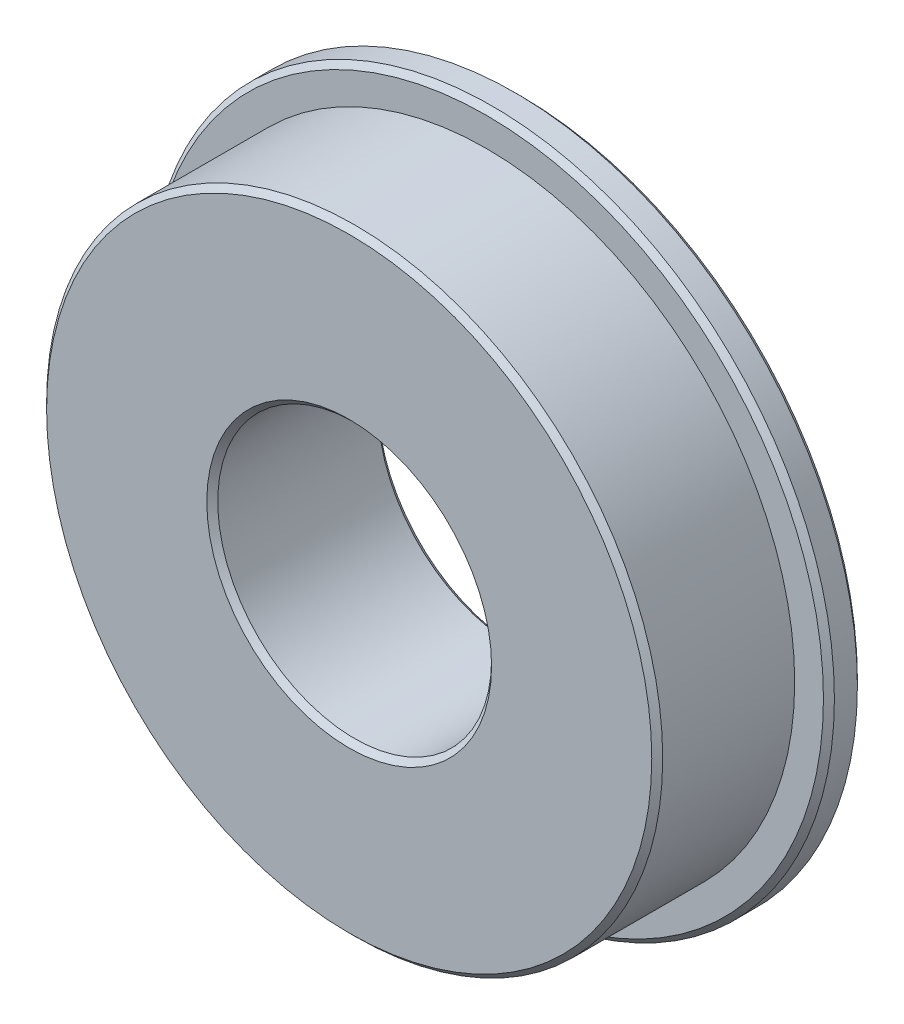
ISO-10303-21;
HEADER;
FILE_DESCRIPTION(('STEP AP214'),'2;1');
FILE_NAME('part.step','',(''),(''),'','','');
FILE_SCHEMA(('AUTOMOTIVE_DESIGN { 1 0 10303 214 1 1 1 1 }'));
ENDSEC;
DATA;
#1=APPLICATION_CONTEXT('core data for automotive mechanical design processes');
#2=APPLICATION_PROTOCOL_DEFINITION('international standard','automotive_design',2000,#1);
#3=PRODUCT_CONTEXT('',#1,'mechanical');
#4=PRODUCT('Part','Part','',(#3));
#5=PRODUCT_RELATED_PRODUCT_CATEGORY('part','',(#4));
#6=PRODUCT_DEFINITION_FORMATION('','',#4);
#7=PRODUCT_DEFINITION_CONTEXT('part definition',#1,'design');
#8=PRODUCT_DEFINITION('design','',#6,#7);
#9=PRODUCT_DEFINITION_SHAPE('','',#8);
#10=(LENGTH_UNIT() NAMED_UNIT(*) SI_UNIT(.MILLI.,.METRE.));
#11=(NAMED_UNIT(*) PLANE_ANGLE_UNIT() SI_UNIT($,.RADIAN.));
#12=(NAMED_UNIT(*) SI_UNIT($,.STERADIAN.) SOLID_ANGLE_UNIT());
#13=UNCERTAINTY_MEASURE_WITH_UNIT(LENGTH_MEASURE(1.E-05),#10,'distance_accuracy_value','');
#14=(GEOMETRIC_REPRESENTATION_CONTEXT(3) GLOBAL_UNCERTAINTY_ASSIGNED_CONTEXT((#13)) GLOBAL_UNIT_ASSIGNED_CONTEXT((#10,
#11,#12)) REPRESENTATION_CONTEXT('',''));
#15=CARTESIAN_POINT('',(0.,0.,0.));
#16=DIRECTION('',(0.,0.,1.));
#17=DIRECTION('',(1.,0.,0.));
#18=AXIS2_PLACEMENT_3D('',#15,#16,#17);
#19=CARTESIAN_POINT('',(-8.86153846153846,6.04195804195805,7.69619999999998));
#20=DIRECTION('',(0.,0.,-1.));
#21=DIRECTION('',(-1.,0.,0.));
#22=AXIS2_PLACEMENT_3D('',#19,#20,#21);
#23=CONICAL_SURFACE('',#22,14.2875,0.785398163397453);
#24=CARTESIAN_POINT('',(-8.86153846153846,6.04195804195805,7.95019999999999));
#25=DIRECTION('',(0.,0.,-1.));
#26=DIRECTION('',(-1.,0.,0.));
#27=AXIS2_PLACEMENT_3D('',#24,#25,#26);
#28=CIRCLE('',#27,14.0335);
#29=CARTESIAN_POINT('',(-22.8950384615385,6.04195804195805,7.95019999999999));
#30=VERTEX_POINT('',#29);
#31=EDGE_CURVE('E18',#30,#30,#28,.T.);
#32=ORIENTED_EDGE('',*,*,#31,.T.);
#33=EDGE_LOOP('',(#32));
#34=FACE_BOUND('',#33,.T.);
#35=CARTESIAN_POINT('',(-8.86153846153846,6.04195804195805,7.69619999999999));
#36=DIRECTION('',(0.,0.,1.));
#37=DIRECTION('',(1.,0.,0.));
#38=AXIS2_PLACEMENT_3D('',#35,#36,#37);
#39=CIRCLE('',#38,14.2875);
#40=CARTESIAN_POINT('',(5.42596153846154,6.04195804195805,7.69619999999999));
#41=VERTEX_POINT('',#40);
#42=EDGE_CURVE('E30',#41,#41,#39,.F.);
#43=ORIENTED_EDGE('',*,*,#42,.F.);
#44=EDGE_LOOP('',(#43));
#45=FACE_BOUND('',#44,.T.);
#46=ADVANCED_FACE('F15',(#34,#45),#23,.T.);
#47=CARTESIAN_POINT('',(-8.86153846153846,6.04195804195805,7.95019999999999));
#48=DIRECTION('',(0.,0.,1.));
#49=DIRECTION('',(1.,0.,0.));
#50=AXIS2_PLACEMENT_3D('',#47,#48,#49);
#51=CYLINDRICAL_SURFACE('',#50,14.2875);
#52=CARTESIAN_POINT('',(-8.86153846153846,6.04195804195805,1.57479999999999));
#53=DIRECTION('',(0.,0.,1.));
#54=DIRECTION('',(1.,0.,0.));
#55=AXIS2_PLACEMENT_3D('',#52,#53,#54);
#56=CIRCLE('',#55,14.2875);
#57=CARTESIAN_POINT('',(5.42596153846154,6.04195804195805,1.57479999999999));
#58=VERTEX_POINT('',#57);
#59=EDGE_CURVE('E39',#58,#58,#56,.T.);
#60=ORIENTED_EDGE('',*,*,#59,.T.);
#61=EDGE_LOOP('',(#60));
#62=FACE_BOUND('',#61,.T.);
#63=ORIENTED_EDGE('',*,*,#42,.T.);
#64=EDGE_LOOP('',(#63));
#65=FACE_BOUND('',#64,.T.);
#66=ADVANCED_FACE('F49',(#62,#65),#51,.T.);
#67=CARTESIAN_POINT('',(-8.86153846153846,6.04195804195805,7.95019999999999));
#68=DIRECTION('',(0.,0.,-1.));
#69=DIRECTION('',(-1.,0.,0.));
#70=AXIS2_PLACEMENT_3D('',#67,#68,#69);
#71=PLANE('',#70);
#72=ORIENTED_EDGE('',*,*,#31,.F.);
#73=EDGE_LOOP('',(#72));
#74=FACE_BOUND('',#73,.T.);
#75=CARTESIAN_POINT('',(-8.86153846153846,6.04195804195805,7.95019999998203));
#76=DIRECTION('',(0.,0.,1.));
#77=DIRECTION('',(1.,0.,0.));
#78=AXIS2_PLACEMENT_3D('',#75,#76,#77);
#79=CIRCLE('',#78,6.60399999993232);
#80=CARTESIAN_POINT('',(-2.25753846160615,6.04195804195805,7.95019999998203));
#81=VERTEX_POINT('',#80);
#82=EDGE_CURVE('E37',#81,#81,#79,.F.);
#83=ORIENTED_EDGE('',*,*,#82,.T.);
#84=EDGE_LOOP('',(#83));
#85=FACE_BOUND('',#84,.T.);
#86=ADVANCED_FACE('F56',(#74,#85),#71,.F.);
#87=CARTESIAN_POINT('',(-8.86153846153846,6.04195804195805,1.57479999999999));
#88=DIRECTION('',(0.,0.,-1.));
#89=DIRECTION('',(-1.,0.,0.));
#90=AXIS2_PLACEMENT_3D('',#87,#88,#89);
#91=PLANE('',#90);
#92=ORIENTED_EDGE('',*,*,#59,.F.);
#93=EDGE_LOOP('',(#92));
#94=FACE_BOUND('',#93,.T.);
#95=CARTESIAN_POINT('',(-8.86153846153846,6.04195804195805,1.5748));
#96=DIRECTION('',(0.,0.,-1.));
#97=DIRECTION('',(-1.,0.,0.));
#98=AXIS2_PLACEMENT_3D('',#95,#96,#97);
#99=CIRCLE('',#98,15.621);
#100=CARTESIAN_POINT('',(-24.4825384615385,6.04195804195805,1.5748));
#101=VERTEX_POINT('',#100);
#102=EDGE_CURVE('E33',#101,#101,#99,.T.);
#103=ORIENTED_EDGE('',*,*,#102,.F.);
#104=EDGE_LOOP('',(#103));
#105=FACE_BOUND('',#104,.T.);
#106=ADVANCED_FACE('F87',(#94,#105),#91,.F.);
#107=CARTESIAN_POINT('',(-8.86153846153846,6.04195804195805,7.95019999986835));
#108=DIRECTION('',(0.,0.,1.));
#109=DIRECTION('',(1.,0.,0.));
#110=AXIS2_PLACEMENT_3D('',#107,#108,#109);
#111=CONICAL_SURFACE('',#110,6.60399999981863,0.785398163285552);
#112=CARTESIAN_POINT('',(-8.86153846153846,6.04195804195805,7.69619999999999));
#113=DIRECTION('',(0.,0.,1.));
#114=DIRECTION('',(1.,0.,0.));
#115=AXIS2_PLACEMENT_3D('',#112,#113,#114);
#116=CIRCLE('',#115,6.35);
#117=CARTESIAN_POINT('',(-2.51153846153846,6.04195804195805,7.69619999999999));
#118=VERTEX_POINT('',#117);
#119=EDGE_CURVE('E36',#118,#118,#116,.F.);
#120=ORIENTED_EDGE('',*,*,#119,.T.);
#121=EDGE_LOOP('',(#120));
#122=FACE_BOUND('',#121,.T.);
#123=ORIENTED_EDGE('',*,*,#82,.F.);
#124=EDGE_LOOP('',(#123));
#125=FACE_BOUND('',#124,.T.);
#126=ADVANCED_FACE('F83',(#122,#125),#111,.F.);
#127=CARTESIAN_POINT('',(-8.86153846153846,6.04195804195805,1.32080000000001));
#128=DIRECTION('',(0.,0.,-1.));
#129=DIRECTION('',(-1.,0.,0.));
#130=AXIS2_PLACEMENT_3D('',#127,#128,#129);
#131=CONICAL_SURFACE('',#130,15.875,0.785398163397452);
#132=CARTESIAN_POINT('',(-8.86153846153846,6.04195804195805,1.32080000000001));
#133=DIRECTION('',(0.,0.,1.));
#134=DIRECTION('',(1.,0.,0.));
#135=AXIS2_PLACEMENT_3D('',#132,#133,#134);
#136=CIRCLE('',#135,15.875);
#137=CARTESIAN_POINT('',(7.01346153846154,6.04195804195805,1.32080000000001));
#138=VERTEX_POINT('',#137);
#139=EDGE_CURVE('E171',#138,#138,#136,.F.);
#140=ORIENTED_EDGE('',*,*,#139,.F.);
#141=EDGE_LOOP('',(#140));
#142=FACE_BOUND('',#141,.T.);
#143=ORIENTED_EDGE('',*,*,#102,.T.);
#144=EDGE_LOOP('',(#143));
#145=FACE_BOUND('',#144,.T.);
#146=ADVANCED_FACE('F79',(#142,#145),#131,.T.);
#147=CARTESIAN_POINT('',(-8.86153846153846,6.04195804195805,1.57479999999999));
#148=DIRECTION('',(0.,0.,1.));
#149=DIRECTION('',(1.,0.,0.));
#150=AXIS2_PLACEMENT_3D('',#147,#148,#149);
#151=CYLINDRICAL_SURFACE('',#150,6.35);
#152=ORIENTED_EDGE('',*,*,#119,.F.);
#153=EDGE_LOOP('',(#152));
#154=FACE_BOUND('',#153,.T.);
#155=CARTESIAN_POINT('',(-8.86153846153846,6.04195804195805,0.253999999927146));
#156=DIRECTION('',(0.,0.,-1.));
#157=DIRECTION('',(-1.,0.,0.));
#158=AXIS2_PLACEMENT_3D('',#155,#156,#157);
#159=CIRCLE('',#158,6.3499999999901);
#160=CARTESIAN_POINT('',(-15.2115384615286,6.04195804195805,0.253999999927146));
#161=VERTEX_POINT('',#160);
#162=EDGE_CURVE('E173',#161,#161,#159,.T.);
#163=ORIENTED_EDGE('',*,*,#162,.T.);
#164=EDGE_LOOP('',(#163));
#165=FACE_BOUND('',#164,.T.);
#166=ADVANCED_FACE('F75',(#154,#165),#151,.F.);
#167=CARTESIAN_POINT('',(-8.86153846153846,6.04195804195805,1.57479999999999));
#168=DIRECTION('',(0.,0.,1.));
#169=DIRECTION('',(1.,0.,0.));
#170=AXIS2_PLACEMENT_3D('',#167,#168,#169);
#171=CYLINDRICAL_SURFACE('',#170,15.875);
#172=CARTESIAN_POINT('',(-8.86153846153846,6.04195804195805,0.254000000000001));
#173=DIRECTION('',(0.,0.,1.));
#174=DIRECTION('',(1.,0.,0.));
#175=AXIS2_PLACEMENT_3D('',#172,#173,#174);
#176=CIRCLE('',#175,15.875);
#177=CARTESIAN_POINT('',(7.01346153846154,6.04195804195805,0.254000000000002));
#178=VERTEX_POINT('',#177);
#179=EDGE_CURVE('E27',#178,#178,#176,.F.);
#180=ORIENTED_EDGE('',*,*,#179,.F.);
#181=EDGE_LOOP('',(#180));
#182=FACE_BOUND('',#181,.T.);
#183=ORIENTED_EDGE('',*,*,#139,.T.);
#184=EDGE_LOOP('',(#183));
#185=FACE_BOUND('',#184,.T.);
#186=ADVANCED_FACE('F71',(#182,#185),#171,.T.);
#187=CARTESIAN_POINT('',(-8.86153846153846,6.04195804195805,-5.6843418860808E-11));
#188=DIRECTION('',(0.,0.,-1.));
#189=DIRECTION('',(-1.,0.,0.));
#190=AXIS2_PLACEMENT_3D('',#187,#188,#189);
#191=CONICAL_SURFACE('',#190,6.60399999997409,0.785398163397448);
#192=ORIENTED_EDGE('',*,*,#162,.F.);
#193=EDGE_LOOP('',(#192));
#194=FACE_BOUND('',#193,.T.);
#195=CARTESIAN_POINT('',(-8.86153846153846,6.04195804195805,-5.6843418860808E-11));
#196=DIRECTION('',(0.,0.,-1.));
#197=DIRECTION('',(-1.,0.,0.));
#198=AXIS2_PLACEMENT_3D('',#195,#196,#197);
#199=CIRCLE('',#198,6.60399999997409);
#200=CARTESIAN_POINT('',(-15.4655384615126,6.04195804195805,-5.6843418860808E-11));
#201=VERTEX_POINT('',#200);
#202=EDGE_CURVE('E22',#201,#201,#199,.F.);
#203=ORIENTED_EDGE('',*,*,#202,.F.);
#204=EDGE_LOOP('',(#203));
#205=FACE_BOUND('',#204,.T.);
#206=ADVANCED_FACE('F64',(#194,#205),#191,.F.);
#207=CARTESIAN_POINT('',(-8.86153846153846,6.04195804195805,0.254000000000001));
#208=DIRECTION('',(0.,0.,1.));
#209=DIRECTION('',(1.,0.,0.));
#210=AXIS2_PLACEMENT_3D('',#207,#208,#209);
#211=CONICAL_SURFACE('',#210,15.875,0.785398163397447);
#212=ORIENTED_EDGE('',*,*,#179,.T.);
#213=EDGE_LOOP('',(#212));
#214=FACE_BOUND('',#213,.T.);
#215=CARTESIAN_POINT('',(-8.86153846153846,6.04195804195805,0.));
#216=DIRECTION('',(0.,0.,1.));
#217=DIRECTION('',(1.,0.,0.));
#218=AXIS2_PLACEMENT_3D('',#215,#216,#217);
#219=CIRCLE('',#218,15.621);
#220=CARTESIAN_POINT('',(6.75946153846154,6.04195804195805,0.));
#221=VERTEX_POINT('',#220);
#222=EDGE_CURVE('E10',#221,#221,#219,.F.);
#223=ORIENTED_EDGE('',*,*,#222,.F.);
#224=EDGE_LOOP('',(#223));
#225=FACE_BOUND('',#224,.T.);
#226=ADVANCED_FACE('F59',(#214,#225),#211,.T.);
#227=CARTESIAN_POINT('',(-8.86153846153846,6.04195804195805,0.));
#228=DIRECTION('',(0.,0.,-1.));
#229=DIRECTION('',(-1.,0.,0.));
#230=AXIS2_PLACEMENT_3D('',#227,#228,#229);
#231=PLANE('',#230);
#232=ORIENTED_EDGE('',*,*,#222,.T.);
#233=EDGE_LOOP('',(#232));
#234=FACE_BOUND('',#233,.T.);
#235=ORIENTED_EDGE('',*,*,#202,.T.);
#236=EDGE_LOOP('',(#235));
#237=FACE_BOUND('',#236,.T.);
#238=ADVANCED_FACE('F57',(#234,#237),#231,.T.);
#239=CLOSED_SHELL('',(#46,#66,#86,#106,#126,#146,#166,#186,#206,#226,#238));
#240=MANIFOLD_SOLID_BREP('B1',#239);
#241=ADVANCED_BREP_SHAPE_REPRESENTATION('',(#18,#240),#14);
#242=SHAPE_DEFINITION_REPRESENTATION(#9,#241);
ENDSEC;
END-ISO-10303-21;
